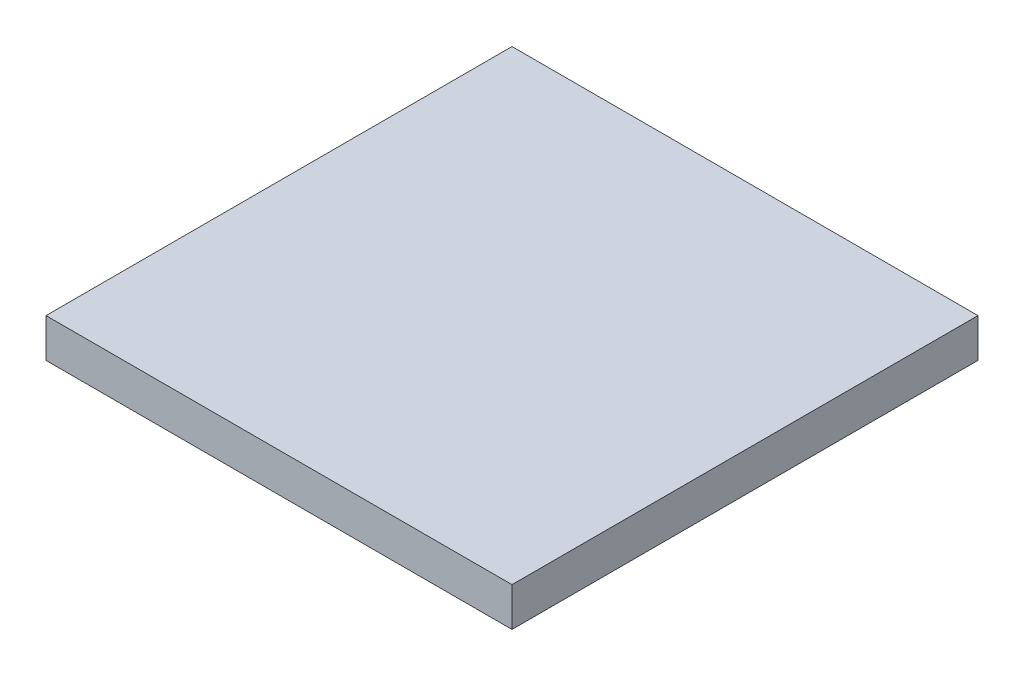
ISO-10303-21;
HEADER;
FILE_DESCRIPTION(('STEP AP214'),'2;1');
FILE_NAME('part.step','',(''),(''),'','','');
FILE_SCHEMA(('AUTOMOTIVE_DESIGN { 1 0 10303 214 1 1 1 1 }'));
ENDSEC;
DATA;
#1=APPLICATION_CONTEXT('core data for automotive mechanical design processes');
#2=APPLICATION_PROTOCOL_DEFINITION('international standard','automotive_design',2000,#1);
#3=PRODUCT_CONTEXT('',#1,'mechanical');
#4=PRODUCT('Part','Part','',(#3));
#5=PRODUCT_RELATED_PRODUCT_CATEGORY('part','',(#4));
#6=PRODUCT_DEFINITION_FORMATION('','',#4);
#7=PRODUCT_DEFINITION_CONTEXT('part definition',#1,'design');
#8=PRODUCT_DEFINITION('design','',#6,#7);
#9=PRODUCT_DEFINITION_SHAPE('','',#8);
#10=(LENGTH_UNIT() NAMED_UNIT(*) SI_UNIT(.MILLI.,.METRE.));
#11=(NAMED_UNIT(*) PLANE_ANGLE_UNIT() SI_UNIT($,.RADIAN.));
#12=(NAMED_UNIT(*) SI_UNIT($,.STERADIAN.) SOLID_ANGLE_UNIT());
#13=UNCERTAINTY_MEASURE_WITH_UNIT(LENGTH_MEASURE(1.E-05),#10,'distance_accuracy_value','');
#14=(GEOMETRIC_REPRESENTATION_CONTEXT(3) GLOBAL_UNCERTAINTY_ASSIGNED_CONTEXT((#13)) GLOBAL_UNIT_ASSIGNED_CONTEXT((#10,
#11,#12)) REPRESENTATION_CONTEXT('',''));
#15=CARTESIAN_POINT('',(0.,0.,0.));
#16=DIRECTION('',(0.,0.,1.));
#17=DIRECTION('',(1.,0.,0.));
#18=AXIS2_PLACEMENT_3D('',#15,#16,#17);
#19=CARTESIAN_POINT('',(0.,1.,0.));
#20=DIRECTION('',(0.,1.,0.));
#21=DIRECTION('',(1.,0.,0.));
#22=AXIS2_PLACEMENT_3D('',#19,#20,#21);
#23=PLANE('',#22);
#24=DIRECTION('',(1.,0.,0.));
#25=VECTOR('',#24,1.);
#26=CARTESIAN_POINT('',(0.,1.,6.));
#27=LINE('',#26,#25);
#28=CARTESIAN_POINT('',(-6.,1.,6.));
#29=VERTEX_POINT('',#28);
#30=CARTESIAN_POINT('',(6.,1.,6.));
#31=VERTEX_POINT('',#30);
#32=EDGE_CURVE('E11',#29,#31,#27,.T.);
#33=ORIENTED_EDGE('',*,*,#32,.T.);
#34=DIRECTION('',(0.,0.,-1.));
#35=VECTOR('',#34,1.);
#36=CARTESIAN_POINT('',(6.,1.,0.));
#37=LINE('',#36,#35);
#38=CARTESIAN_POINT('',(6.,1.,-6.));
#39=VERTEX_POINT('',#38);
#40=EDGE_CURVE('E27',#31,#39,#37,.T.);
#41=ORIENTED_EDGE('',*,*,#40,.T.);
#42=DIRECTION('',(-1.,0.,0.));
#43=VECTOR('',#42,1.);
#44=CARTESIAN_POINT('',(0.,1.,-6.));
#45=LINE('',#44,#43);
#46=CARTESIAN_POINT('',(-6.,1.,-6.));
#47=VERTEX_POINT('',#46);
#48=EDGE_CURVE('E21',#39,#47,#45,.T.);
#49=ORIENTED_EDGE('',*,*,#48,.T.);
#50=DIRECTION('',(0.,0.,1.));
#51=VECTOR('',#50,1.);
#52=CARTESIAN_POINT('',(-6.,1.,0.));
#53=LINE('',#52,#51);
#54=EDGE_CURVE('E113',#47,#29,#53,.T.);
#55=ORIENTED_EDGE('',*,*,#54,.T.);
#56=EDGE_LOOP('',(#33,#41,#49,#55));
#57=FACE_BOUND('',#56,.T.);
#58=ADVANCED_FACE('F17',(#57),#23,.T.);
#59=CARTESIAN_POINT('',(6.,0.,6.));
#60=DIRECTION('',(1.,0.,0.));
#61=DIRECTION('',(0.,1.,0.));
#62=AXIS2_PLACEMENT_3D('',#59,#60,#61);
#63=PLANE('',#62);
#64=DIRECTION('',(0.,0.,-1.));
#65=VECTOR('',#64,1.);
#66=CARTESIAN_POINT('',(6.,0.,6.));
#67=LINE('',#66,#65);
#68=CARTESIAN_POINT('',(6.,0.,6.));
#69=VERTEX_POINT('',#68);
#70=CARTESIAN_POINT('',(6.,0.,-6.));
#71=VERTEX_POINT('',#70);
#72=EDGE_CURVE('E97',#69,#71,#67,.T.);
#73=ORIENTED_EDGE('',*,*,#72,.T.);
#74=DIRECTION('',(0.,1.,0.));
#75=VECTOR('',#74,1.);
#76=CARTESIAN_POINT('',(6.,0.,-6.));
#77=LINE('',#76,#75);
#78=EDGE_CURVE('E119',#71,#39,#77,.T.);
#79=ORIENTED_EDGE('',*,*,#78,.T.);
#80=ORIENTED_EDGE('',*,*,#40,.F.);
#81=DIRECTION('',(0.,-1.,0.));
#82=VECTOR('',#81,1.);
#83=CARTESIAN_POINT('',(6.,0.,6.));
#84=LINE('',#83,#82);
#85=EDGE_CURVE('E99',#31,#69,#84,.T.);
#86=ORIENTED_EDGE('',*,*,#85,.T.);
#87=EDGE_LOOP('',(#73,#79,#80,#86));
#88=FACE_BOUND('',#87,.T.);
#89=ADVANCED_FACE('F131',(#88),#63,.T.);
#90=CARTESIAN_POINT('',(-6.,0.,6.));
#91=DIRECTION('',(0.,0.,1.));
#92=DIRECTION('',(1.,0.,0.));
#93=AXIS2_PLACEMENT_3D('',#90,#91,#92);
#94=PLANE('',#93);
#95=DIRECTION('',(1.,0.,0.));
#96=VECTOR('',#95,1.);
#97=CARTESIAN_POINT('',(-6.,0.,6.));
#98=LINE('',#97,#96);
#99=CARTESIAN_POINT('',(-6.,0.,6.));
#100=VERTEX_POINT('',#99);
#101=EDGE_CURVE('E87',#100,#69,#98,.T.);
#102=ORIENTED_EDGE('',*,*,#101,.T.);
#103=ORIENTED_EDGE('',*,*,#85,.F.);
#104=ORIENTED_EDGE('',*,*,#32,.F.);
#105=DIRECTION('',(0.,-1.,0.));
#106=VECTOR('',#105,1.);
#107=CARTESIAN_POINT('',(-6.,0.,6.));
#108=LINE('',#107,#106);
#109=EDGE_CURVE('E83',#29,#100,#108,.T.);
#110=ORIENTED_EDGE('',*,*,#109,.T.);
#111=EDGE_LOOP('',(#102,#103,#104,#110));
#112=FACE_BOUND('',#111,.T.);
#113=ADVANCED_FACE('F85',(#112),#94,.T.);
#114=CARTESIAN_POINT('',(-6.,0.,-6.));
#115=DIRECTION('',(-1.,0.,0.));
#116=DIRECTION('',(0.,0.,1.));
#117=AXIS2_PLACEMENT_3D('',#114,#115,#116);
#118=PLANE('',#117);
#119=DIRECTION('',(0.,0.,1.));
#120=VECTOR('',#119,1.);
#121=CARTESIAN_POINT('',(-6.,0.,-6.));
#122=LINE('',#121,#120);
#123=CARTESIAN_POINT('',(-6.,0.,-6.));
#124=VERTEX_POINT('',#123);
#125=EDGE_CURVE('E89',#124,#100,#122,.T.);
#126=ORIENTED_EDGE('',*,*,#125,.T.);
#127=ORIENTED_EDGE('',*,*,#109,.F.);
#128=ORIENTED_EDGE('',*,*,#54,.F.);
#129=DIRECTION('',(0.,-1.,0.));
#130=VECTOR('',#129,1.);
#131=CARTESIAN_POINT('',(-6.,0.,-6.));
#132=LINE('',#131,#130);
#133=EDGE_CURVE('E73',#47,#124,#132,.T.);
#134=ORIENTED_EDGE('',*,*,#133,.T.);
#135=EDGE_LOOP('',(#126,#127,#128,#134));
#136=FACE_BOUND('',#135,.T.);
#137=ADVANCED_FACE('F19',(#136),#118,.T.);
#138=CARTESIAN_POINT('',(6.,0.,-6.));
#139=DIRECTION('',(0.,0.,-1.));
#140=DIRECTION('',(0.,-1.,0.));
#141=AXIS2_PLACEMENT_3D('',#138,#139,#140);
#142=PLANE('',#141);
#143=DIRECTION('',(-1.,0.,0.));
#144=VECTOR('',#143,1.);
#145=CARTESIAN_POINT('',(6.,0.,-6.));
#146=LINE('',#145,#144);
#147=EDGE_CURVE('E108',#71,#124,#146,.T.);
#148=ORIENTED_EDGE('',*,*,#147,.T.);
#149=ORIENTED_EDGE('',*,*,#133,.F.);
#150=ORIENTED_EDGE('',*,*,#48,.F.);
#151=ORIENTED_EDGE('',*,*,#78,.F.);
#152=EDGE_LOOP('',(#148,#149,#150,#151));
#153=FACE_BOUND('',#152,.T.);
#154=ADVANCED_FACE('F142',(#153),#142,.T.);
#155=CARTESIAN_POINT('',(0.,0.,0.));
#156=DIRECTION('',(0.,1.,0.));
#157=DIRECTION('',(1.,0.,0.));
#158=AXIS2_PLACEMENT_3D('',#155,#156,#157);
#159=PLANE('',#158);
#160=ORIENTED_EDGE('',*,*,#147,.F.);
#161=ORIENTED_EDGE('',*,*,#72,.F.);
#162=ORIENTED_EDGE('',*,*,#101,.F.);
#163=ORIENTED_EDGE('',*,*,#125,.F.);
#164=EDGE_LOOP('',(#160,#161,#162,#163));
#165=FACE_BOUND('',#164,.T.);
#166=ADVANCED_FACE('F94',(#165),#159,.F.);
#167=CLOSED_SHELL('',(#58,#89,#113,#137,#154,#166));
#168=MANIFOLD_SOLID_BREP('B1',#167);
#169=ADVANCED_BREP_SHAPE_REPRESENTATION('',(#18,#168),#14);
#170=SHAPE_DEFINITION_REPRESENTATION(#9,#169);
ENDSEC;
END-ISO-10303-21;
